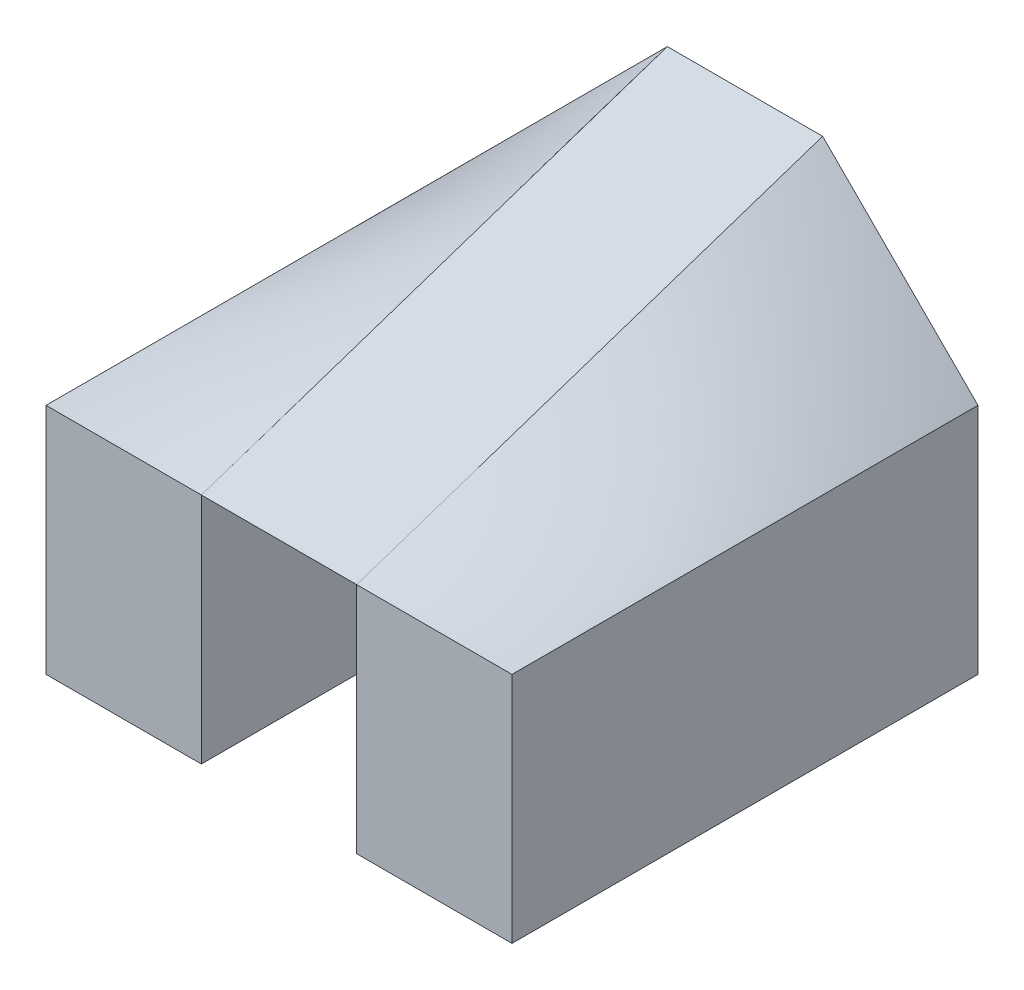
ISO-10303-21;
HEADER;
FILE_DESCRIPTION(('STEP AP214'),'2;1');
FILE_NAME('part.step','',(''),(''),'','','');
FILE_SCHEMA(('AUTOMOTIVE_DESIGN { 1 0 10303 214 1 1 1 1 }'));
ENDSEC;
DATA;
#1=APPLICATION_CONTEXT('core data for automotive mechanical design processes');
#2=APPLICATION_PROTOCOL_DEFINITION('international standard','automotive_design',2000,#1);
#3=PRODUCT_CONTEXT('',#1,'mechanical');
#4=PRODUCT('Part','Part','',(#3));
#5=PRODUCT_RELATED_PRODUCT_CATEGORY('part','',(#4));
#6=PRODUCT_DEFINITION_FORMATION('','',#4);
#7=PRODUCT_DEFINITION_CONTEXT('part definition',#1,'design');
#8=PRODUCT_DEFINITION('design','',#6,#7);
#9=PRODUCT_DEFINITION_SHAPE('','',#8);
#10=(LENGTH_UNIT() NAMED_UNIT(*) SI_UNIT(.MILLI.,.METRE.));
#11=(NAMED_UNIT(*) PLANE_ANGLE_UNIT() SI_UNIT($,.RADIAN.));
#12=(NAMED_UNIT(*) SI_UNIT($,.STERADIAN.) SOLID_ANGLE_UNIT());
#13=UNCERTAINTY_MEASURE_WITH_UNIT(LENGTH_MEASURE(1.E-05),#10,'distance_accuracy_value','');
#14=(GEOMETRIC_REPRESENTATION_CONTEXT(3) GLOBAL_UNCERTAINTY_ASSIGNED_CONTEXT((#13)) GLOBAL_UNIT_ASSIGNED_CONTEXT((#10,
#11,#12)) REPRESENTATION_CONTEXT('',''));
#15=CARTESIAN_POINT('',(0.,0.,0.));
#16=DIRECTION('',(0.,0.,1.));
#17=DIRECTION('',(1.,0.,0.));
#18=AXIS2_PLACEMENT_3D('',#15,#16,#17);
#19=CARTESIAN_POINT('',(-3.,5.,3.));
#20=DIRECTION('',(0.,0.,-1.));
#21=DIRECTION('',(-1.,0.,0.));
#22=AXIS2_PLACEMENT_3D('',#19,#20,#21);
#23=PLANE('',#22);
#24=DIRECTION('',(0.,-1.,0.));
#25=VECTOR('',#24,1.);
#26=CARTESIAN_POINT('',(-1.,0.,3.));
#27=LINE('',#26,#25);
#28=CARTESIAN_POINT('',(-1.0000279501249,3.00060685749691,3.00000931670194));
#29=VERTEX_POINT('',#28);
#30=CARTESIAN_POINT('',(-1.,0.,3.));
#31=VERTEX_POINT('',#30);
#32=EDGE_CURVE('E283',#29,#31,#27,.T.);
#33=ORIENTED_EDGE('',*,*,#32,.F.);
#34=CARTESIAN_POINT('',(-2.99959848829282,2.99919697658563,2.99986616276427));
#35=CARTESIAN_POINT('',(-2.91647727481364,2.99979623435169,2.99996603905861));
#36=CARTESIAN_POINT('',(-2.83335501740166,3.00020355740001,3.00003392623333));
#37=CARTESIAN_POINT('',(-2.66696415510001,3.00072593941439,3.0001209899024));
#38=CARTESIAN_POINT('',(-2.58369554846091,3.00084048608403,3.00014008101401));
#39=CARTESIAN_POINT('',(-2.41705834700196,3.00086747866127,3.00014457977688));
#40=CARTESIAN_POINT('',(-2.33368975229141,3.00077968150188,3.00012994691698));
#41=CARTESIAN_POINT('',(-2.16690313525018,3.00050526432254,3.00008421072042));
#42=CARTESIAN_POINT('',(-2.08348511303799,3.0003185855076,3.0000530975846));
#43=CARTESIAN_POINT('',(-1.91665073254185,2.9999497594847,2.99999162658078));
#44=CARTESIAN_POINT('',(-1.83323437425811,2.99976761218586,2.99996126869764));
#45=CARTESIAN_POINT('',(-1.66645095476638,2.99950413098206,2.99991735516368));
#46=CARTESIAN_POINT('',(-1.58308389367629,2.99942273732277,2.9999037895538));
#47=CARTESIAN_POINT('',(-1.41643937923708,2.99944448661917,2.99990741443653));
#48=CARTESIAN_POINT('',(-1.33316192593796,2.99954743121545,2.99992457186924));
#49=CARTESIAN_POINT('',(-1.16672592382412,2.99999150327888,2.99999858387982));
#50=CARTESIAN_POINT('',(-1.08356737404379,3.00033229240378,3.0000553820673));
#51=CARTESIAN_POINT('',(-1.00040952562356,3.00081905012939,3.0001365083549));
#52=B_SPLINE_CURVE_WITH_KNOTS('',3,(#34,#35,#36,#37,#38,#39,#40,#41,#42,#43,#44,#45,#46,#47,#48,
#49,#50,#51),.UNSPECIFIED.,.F.,.F.,(4,2,2,2,2,2,2,2,4),(0.,0.249369539063633,0.499175124002452,
0.749280946073541,0.999535648191619,1.24978532717036,1.49988651845285,1.749718747041,
1.99919630290931),.UNSPECIFIED.);
#53=CARTESIAN_POINT('',(-3.,2.99959683599818,3.));
#54=VERTEX_POINT('',#53);
#55=EDGE_CURVE('E77',#54,#29,#52,.T.);
#56=ORIENTED_EDGE('',*,*,#55,.F.);
#57=DIRECTION('',(0.,-1.,0.));
#58=VECTOR('',#57,1.);
#59=CARTESIAN_POINT('',(-3.,5.,3.));
#60=LINE('',#59,#58);
#61=CARTESIAN_POINT('',(-3.,0.,3.));
#62=VERTEX_POINT('',#61);
#63=EDGE_CURVE('E114',#54,#62,#60,.T.);
#64=ORIENTED_EDGE('',*,*,#63,.T.);
#65=DIRECTION('',(1.,0.,0.));
#66=VECTOR('',#65,1.);
#67=CARTESIAN_POINT('',(-3.,0.,3.));
#68=LINE('',#67,#66);
#69=EDGE_CURVE('E128',#62,#31,#68,.T.);
#70=ORIENTED_EDGE('',*,*,#69,.T.);
#71=EDGE_LOOP('',(#33,#56,#64,#70));
#72=FACE_BOUND('',#71,.T.);
#73=ADVANCED_FACE('F33',(#72),#23,.F.);
#74=CARTESIAN_POINT('',(0.,0.,0.));
#75=DIRECTION('',(0.,-1.,0.));
#76=DIRECTION('',(0.,0.,-1.));
#77=AXIS2_PLACEMENT_3D('',#74,#75,#76);
#78=PLANE('',#77);
#79=DIRECTION('',(-1.,0.,0.));
#80=VECTOR('',#79,1.);
#81=CARTESIAN_POINT('',(-3.,0.,-3.));
#82=LINE('',#81,#80);
#83=CARTESIAN_POINT('',(-1.,0.,-3.));
#84=VERTEX_POINT('',#83);
#85=CARTESIAN_POINT('',(-3.,0.,-3.));
#86=VERTEX_POINT('',#85);
#87=EDGE_CURVE('E117',#84,#86,#82,.T.);
#88=ORIENTED_EDGE('',*,*,#87,.F.);
#89=DIRECTION('',(0.,0.,-1.));
#90=VECTOR('',#89,1.);
#91=CARTESIAN_POINT('',(-1.,0.,0.));
#92=LINE('',#91,#90);
#93=EDGE_CURVE('E275',#31,#84,#92,.T.);
#94=ORIENTED_EDGE('',*,*,#93,.F.);
#95=ORIENTED_EDGE('',*,*,#69,.F.);
#96=DIRECTION('',(0.,0.,1.));
#97=VECTOR('',#96,1.);
#98=CARTESIAN_POINT('',(-3.,0.,3.));
#99=LINE('',#98,#97);
#100=EDGE_CURVE('E107',#86,#62,#99,.T.);
#101=ORIENTED_EDGE('',*,*,#100,.F.);
#102=EDGE_LOOP('',(#88,#94,#95,#101));
#103=FACE_BOUND('',#102,.T.);
#104=ADVANCED_FACE('F126',(#103),#78,.T.);
#105=DIRECTION('',(0.,-1.,0.));
#106=VECTOR('',#105,1.);
#107=CARTESIAN_POINT('',(3.,5.,3.));
#108=LINE('',#107,#106);
#109=CARTESIAN_POINT('',(3.,2.99959683599818,3.));
#110=VERTEX_POINT('',#109);
#111=CARTESIAN_POINT('',(3.,0.,3.));
#112=VERTEX_POINT('',#111);
#113=EDGE_CURVE('E63',#110,#112,#108,.T.);
#114=ORIENTED_EDGE('',*,*,#113,.F.);
#115=CARTESIAN_POINT('',(1.00040952562356,3.00081905012939,3.0001365083549));
#116=CARTESIAN_POINT('',(1.08356737404379,3.00033229240378,3.0000553820673));
#117=CARTESIAN_POINT('',(1.16672592382412,2.99999150327888,2.99999858387981));
#118=CARTESIAN_POINT('',(1.33316192593796,2.99954743121545,2.99992457186924));
#119=CARTESIAN_POINT('',(1.41643937923708,2.99944448661917,2.99990741443653));
#120=CARTESIAN_POINT('',(1.58308389367629,2.99942273732277,2.9999037895538));
#121=CARTESIAN_POINT('',(1.66645095476638,2.99950413098206,2.99991735516368));
#122=CARTESIAN_POINT('',(1.83323437425811,2.99976761218586,2.99996126869764));
#123=CARTESIAN_POINT('',(1.91665073254185,2.9999497594847,2.99999162658078));
#124=CARTESIAN_POINT('',(2.08348511303799,3.0003185855076,3.0000530975846));
#125=CARTESIAN_POINT('',(2.16690313525018,3.00050526432254,3.00008421072042));
#126=CARTESIAN_POINT('',(2.33368975229141,3.00077968150188,3.00012994691698));
#127=CARTESIAN_POINT('',(2.41705834700195,3.00086747866127,3.00014457977688));
#128=CARTESIAN_POINT('',(2.58369554846091,3.00084048608404,3.00014008101401));
#129=CARTESIAN_POINT('',(2.6669641551,3.00072593941439,3.0001209899024));
#130=CARTESIAN_POINT('',(2.83335501740166,3.00020355740001,3.00003392623333));
#131=CARTESIAN_POINT('',(2.91647727481364,2.99979623435169,2.99996603905861));
#132=CARTESIAN_POINT('',(2.99959848829282,2.99919697658563,2.99986616276427));
#133=B_SPLINE_CURVE_WITH_KNOTS('',3,(#115,#116,#117,#118,#119,#120,#121,#122,#123,#124,#125,
#126,#127,#128,#129,#130,#131,#132),.UNSPECIFIED.,.F.,.F.,(4,2,2,2,2,2,2,2,4),(0.,
0.249477555868311,0.499309784456458,0.749410975738948,0.999660654717689,1.24991535683577,
1.50002117890685,1.74982676384567,1.99919630290931),.UNSPECIFIED.);
#134=CARTESIAN_POINT('',(1.0001127605496,3.00061488382368,3.00003758682422));
#135=VERTEX_POINT('',#134);
#136=EDGE_CURVE('E163',#110,#135,#133,.F.);
#137=ORIENTED_EDGE('',*,*,#136,.T.);
#138=DIRECTION('',(0.,-1.,0.));
#139=VECTOR('',#138,1.);
#140=CARTESIAN_POINT('',(1.,0.,3.));
#141=LINE('',#140,#139);
#142=CARTESIAN_POINT('',(1.,0.,3.));
#143=VERTEX_POINT('',#142);
#144=EDGE_CURVE('E280',#135,#143,#141,.T.);
#145=ORIENTED_EDGE('',*,*,#144,.T.);
#146=EDGE_CURVE('E129',#143,#112,#68,.T.);
#147=ORIENTED_EDGE('',*,*,#146,.T.);
#148=EDGE_LOOP('',(#114,#137,#145,#147));
#149=FACE_BOUND('',#148,.T.);
#150=ADVANCED_FACE('F170',(#149),#23,.F.);
#151=CARTESIAN_POINT('',(3.,5.,3.));
#152=DIRECTION('',(-1.,0.,0.));
#153=DIRECTION('',(0.,0.,1.));
#154=AXIS2_PLACEMENT_3D('',#151,#152,#153);
#155=PLANE('',#154);
#156=DIRECTION('',(0.,-1.,0.));
#157=VECTOR('',#156,1.);
#158=CARTESIAN_POINT('',(3.,5.,-3.));
#159=LINE('',#158,#157);
#160=CARTESIAN_POINT('',(3.,3.00012492231327,-3.));
#161=VERTEX_POINT('',#160);
#162=CARTESIAN_POINT('',(3.,0.,-3.));
#163=VERTEX_POINT('',#162);
#164=EDGE_CURVE('E11',#161,#163,#159,.T.);
#165=ORIENTED_EDGE('',*,*,#164,.F.);
#166=CARTESIAN_POINT('',(2.99959848829282,2.99919697658563,2.99986616276427));
#167=CARTESIAN_POINT('',(2.99997593175919,2.99995186351839,2.74992936397604));
#168=CARTESIAN_POINT('',(3.00012683985326,3.00025367970652,2.49999214707375));
#169=CARTESIAN_POINT('',(3.0002017292695,3.000403458539,2.00004205960252));
#170=CARTESIAN_POINT('',(3.00012564219906,3.00025128439812,1.7500291889308));
#171=CARTESIAN_POINT('',(2.99997272777285,2.9999454555457,1.2499950386083));
#172=CARTESIAN_POINT('',(2.99989590039181,2.99979180078362,0.99997375896282));
#173=CARTESIAN_POINT('',(2.99981862202035,2.9996372440407,0.499951634790032));
#174=CARTESIAN_POINT('',(2.99981816475162,2.99963632950325,0.249950790272502));
#175=CARTESIAN_POINT('',(2.99988173538349,2.99976347076698,-0.250032437675042));
#176=CARTESIAN_POINT('',(2.99994575854183,2.99989151708366,-0.500014821110642));
#177=CARTESIAN_POINT('',(3.00007096029036,3.00014192058073,-0.999981075193913));
#178=CARTESIAN_POINT('',(3.00013213886384,3.00026427772768,-1.24996494584169));
#179=CARTESIAN_POINT('',(3.00017487236594,3.00034974473187,-1.7499510908798));
#180=CARTESIAN_POINT('',(3.00015642144206,3.00031284288412,-1.99995336527238));
#181=CARTESIAN_POINT('',(3.00010974711902,3.00021949423804,-2.49996117144019));
#182=CARTESIAN_POINT('',(3.00008152359244,3.00016304718488,-2.74996670321539));
#183=CARTESIAN_POINT('',(3.00008334759396,3.00016669518791,-2.99997221746868));
#184=B_SPLINE_CURVE_WITH_KNOTS('',3,(#166,#167,#168,#169,#170,#171,#172,#173,#174,#175,#176,
#177,#178,#179,#180,#181,#182,#183),.UNSPECIFIED.,.F.,.F.,(4,2,2,2,2,2,2,2,4),(0.,
0.749812470455122,1.4998508788157,2.24991497715056,2.99991741345574,3.74986469444001,
4.49981638280283,5.2498231909918,5.9998397781837),.UNSPECIFIED.);
#185=EDGE_CURVE('E148',#161,#110,#184,.F.);
#186=ORIENTED_EDGE('',*,*,#185,.T.);
#187=ORIENTED_EDGE('',*,*,#113,.T.);
#188=DIRECTION('',(0.,0.,-1.));
#189=VECTOR('',#188,1.);
#190=CARTESIAN_POINT('',(3.,0.,3.));
#191=LINE('',#190,#189);
#192=EDGE_CURVE('E124',#112,#163,#191,.T.);
#193=ORIENTED_EDGE('',*,*,#192,.T.);
#194=EDGE_LOOP('',(#165,#186,#187,#193));
#195=FACE_BOUND('',#194,.T.);
#196=ADVANCED_FACE('F35',(#195),#155,.F.);
#197=CARTESIAN_POINT('',(-3.,5.,-3.));
#198=DIRECTION('',(0.,0.,1.));
#199=DIRECTION('',(1.,0.,0.));
#200=AXIS2_PLACEMENT_3D('',#197,#198,#199);
#201=PLANE('',#200);
#202=DIRECTION('',(1.,0.,0.));
#203=VECTOR('',#202,1.);
#204=CARTESIAN_POINT('',(-1.,5.,-3.));
#205=LINE('',#204,#203);
#206=CARTESIAN_POINT('',(-1.0000651634137,5.,-3.));
#207=VERTEX_POINT('',#206);
#208=CARTESIAN_POINT('',(1.,5.,-2.9998043483756));
#209=VERTEX_POINT('',#208);
#210=EDGE_CURVE('E264',#207,#209,#205,.T.);
#211=ORIENTED_EDGE('',*,*,#210,.T.);
#212=CARTESIAN_POINT('',(3.00008334759396,3.00016669518791,-2.99997221746868));
#213=CARTESIAN_POINT('',(2.91666842650898,3.08337444959412,-2.99999523598855));
#214=CARTESIAN_POINT('',(2.83329704611942,3.16662580070212,-3.00000857257539));
#215=CARTESIAN_POINT('',(2.66658875639256,3.33319745204313,-3.00002375461826));
#216=CARTESIAN_POINT('',(2.58325185773676,3.41651776296814,-3.00002559769946));
#217=CARTESIAN_POINT('',(2.41658796648782,3.58318107134952,-3.00002566246252));
#218=CARTESIAN_POINT('',(2.33326097514583,3.66652407005625,-3.00002388386644));
#219=CARTESIAN_POINT('',(2.16660512041995,3.83320835156353,-3.00002072533517));
#220=CARTESIAN_POINT('',(2.0832762570344,3.91654963436243,-3.00001934540035));
#221=CARTESIAN_POINT('',(1.91661272750829,4.08322252218314,-3.00001830558984));
#222=CARTESIAN_POINT('',(1.83327806154767,4.16655412738492,-3.00001864567416));
#223=CARTESIAN_POINT('',(1.66660685103842,4.33321498008502,-3.00001979654184));
#224=CARTESIAN_POINT('',(1.58327030649585,4.41654422758941,-3.00002060732386));
#225=CARTESIAN_POINT('',(1.41660498689648,4.58321876549208,-3.00001958306794));
#226=CARTESIAN_POINT('',(1.33327621243048,4.66656405648127,-3.00001774789869));
#227=CARTESIAN_POINT('',(1.16663794102537,4.83329319785179,-3.00000765123587));
#228=CARTESIAN_POINT('',(1.08332844743582,4.91667705158057,-2.99999938899818));
#229=CARTESIAN_POINT('',(1.00004193205428,5.00008386410857,-2.99998602264857));
#230=B_SPLINE_CURVE_WITH_KNOTS('',3,(#212,#213,#214,#215,#216,#217,#218,#219,#220,#221,#222,
#223,#224,#225,#226,#227,#228,#229),.UNSPECIFIED.,.F.,.F.,(4,2,2,2,2,2,2,2,4),(0.,
0.353460281812378,0.706993594560062,1.06055404020695,1.41411481182268,1.76766736318887,
2.12121889958134,2.47478798128868,2.82839800455366),.UNSPECIFIED.);
#231=EDGE_CURVE('E255',#209,#161,#230,.F.);
#232=ORIENTED_EDGE('',*,*,#231,.T.);
#233=ORIENTED_EDGE('',*,*,#164,.T.);
#234=CARTESIAN_POINT('',(1.,0.,-3.));
#235=VERTEX_POINT('',#234);
#236=EDGE_CURVE('E123',#163,#235,#82,.T.);
#237=ORIENTED_EDGE('',*,*,#236,.T.);
#238=DIRECTION('',(1.,0.,0.));
#239=VECTOR('',#238,1.);
#240=CARTESIAN_POINT('',(-1.,0.,-3.));
#241=LINE('',#240,#239);
#242=EDGE_CURVE('E90',#84,#235,#241,.T.);
#243=ORIENTED_EDGE('',*,*,#242,.F.);
#244=ORIENTED_EDGE('',*,*,#87,.T.);
#245=DIRECTION('',(0.,-1.,0.));
#246=VECTOR('',#245,1.);
#247=CARTESIAN_POINT('',(-3.,5.,-3.));
#248=LINE('',#247,#246);
#249=CARTESIAN_POINT('',(-3.,3.00012492231327,-3.));
#250=VERTEX_POINT('',#249);
#251=EDGE_CURVE('E45',#250,#86,#248,.T.);
#252=ORIENTED_EDGE('',*,*,#251,.F.);
#253=CARTESIAN_POINT('',(-1.00004193205428,5.00008386410857,-2.99998602264857));
#254=CARTESIAN_POINT('',(-1.08332844743582,4.91667705158057,-2.99999938899818));
#255=CARTESIAN_POINT('',(-1.16663794102537,4.83329319785179,-3.00000765123587));
#256=CARTESIAN_POINT('',(-1.33327621243048,4.66656405648127,-3.00001774789869));
#257=CARTESIAN_POINT('',(-1.41660498689648,4.58321876549208,-3.00001958306794));
#258=CARTESIAN_POINT('',(-1.58327030649585,4.41654422758941,-3.00002060732386));
#259=CARTESIAN_POINT('',(-1.66660685103842,4.33321498008502,-3.00001979654184));
#260=CARTESIAN_POINT('',(-1.83327806154767,4.16655412738492,-3.00001864567416));
#261=CARTESIAN_POINT('',(-1.91661272750829,4.08322252218314,-3.00001830558984));
#262=CARTESIAN_POINT('',(-2.0832762570344,3.91654963436243,-3.00001934540035));
#263=CARTESIAN_POINT('',(-2.16660512041995,3.83320835156353,-3.00002072533517));
#264=CARTESIAN_POINT('',(-2.33326097514583,3.66652407005625,-3.00002388386644));
#265=CARTESIAN_POINT('',(-2.41658796648782,3.58318107134952,-3.00002566246252));
#266=CARTESIAN_POINT('',(-2.58325185773676,3.41651776296814,-3.00002559769946));
#267=CARTESIAN_POINT('',(-2.66658875639256,3.33319745204313,-3.00002375461826));
#268=CARTESIAN_POINT('',(-2.83329704611942,3.16662580070213,-3.00000857257539));
#269=CARTESIAN_POINT('',(-2.91666842650898,3.08337444959412,-2.99999523598855));
#270=CARTESIAN_POINT('',(-3.00008334759396,3.00016669518791,-2.99997221746868));
#271=B_SPLINE_CURVE_WITH_KNOTS('',3,(#253,#254,#255,#256,#257,#258,#259,#260,#261,#262,#263,
#264,#265,#266,#267,#268,#269,#270),.UNSPECIFIED.,.F.,.F.,(4,2,2,2,2,2,2,2,4),(0.,
0.353610023264976,0.707179104972321,1.06073064136479,1.41428319273098,1.76784396434671,
2.1214044099936,2.47493772274128,2.82839800455366),.UNSPECIFIED.);
#272=EDGE_CURVE('E336',#207,#250,#271,.T.);
#273=ORIENTED_EDGE('',*,*,#272,.F.);
#274=EDGE_LOOP('',(#211,#232,#233,#237,#243,#244,#252,#273));
#275=FACE_BOUND('',#274,.T.);
#276=ADVANCED_FACE('F119',(#275),#201,.F.);
#277=CARTESIAN_POINT('',(-3.,5.,3.));
#278=DIRECTION('',(1.,0.,0.));
#279=DIRECTION('',(0.,0.,-1.));
#280=AXIS2_PLACEMENT_3D('',#277,#278,#279);
#281=PLANE('',#280);
#282=ORIENTED_EDGE('',*,*,#63,.F.);
#283=CARTESIAN_POINT('',(-3.00008334759396,3.00016669518791,-2.99997221746868));
#284=CARTESIAN_POINT('',(-3.00008152359244,3.00016304718488,-2.74996670321539));
#285=CARTESIAN_POINT('',(-3.00010974711902,3.00021949423804,-2.49996117144019));
#286=CARTESIAN_POINT('',(-3.00015642144206,3.00031284288412,-1.99995336527238));
#287=CARTESIAN_POINT('',(-3.00017487236594,3.00034974473187,-1.7499510908798));
#288=CARTESIAN_POINT('',(-3.00013213886384,3.00026427772768,-1.24996494584169));
#289=CARTESIAN_POINT('',(-3.00007096029036,3.00014192058073,-0.999981075193913));
#290=CARTESIAN_POINT('',(-2.99994575854183,2.99989151708366,-0.500014821110642));
#291=CARTESIAN_POINT('',(-2.99988173538349,2.99976347076698,-0.250032437675042));
#292=CARTESIAN_POINT('',(-2.99981816475163,2.99963632950325,0.249950790272502));
#293=CARTESIAN_POINT('',(-2.99981862202035,2.9996372440407,0.499951634790032));
#294=CARTESIAN_POINT('',(-2.99989590039181,2.99979180078362,0.99997375896282));
#295=CARTESIAN_POINT('',(-2.99997272777285,2.9999454555457,1.2499950386083));
#296=CARTESIAN_POINT('',(-3.00012564219906,3.00025128439812,1.7500291889308));
#297=CARTESIAN_POINT('',(-3.0002017292695,3.000403458539,2.00004205960252));
#298=CARTESIAN_POINT('',(-3.00012683985326,3.00025367970652,2.49999214707375));
#299=CARTESIAN_POINT('',(-2.99997593175919,2.99995186351839,2.74992936397604));
#300=CARTESIAN_POINT('',(-2.99959848829282,2.99919697658563,2.99986616276427));
#301=B_SPLINE_CURVE_WITH_KNOTS('',3,(#283,#284,#285,#286,#287,#288,#289,#290,#291,#292,#293,
#294,#295,#296,#297,#298,#299,#300),.UNSPECIFIED.,.F.,.F.,(4,2,2,2,2,2,2,2,4),(0.,
0.750016587191901,1.50002339538087,2.24997508374369,2.99992236472796,3.74992480103314,
4.49998889936801,5.25002730772858,5.9998397781837),.UNSPECIFIED.);
#302=EDGE_CURVE('E110',#250,#54,#301,.T.);
#303=ORIENTED_EDGE('',*,*,#302,.F.);
#304=ORIENTED_EDGE('',*,*,#251,.T.);
#305=ORIENTED_EDGE('',*,*,#100,.T.);
#306=EDGE_LOOP('',(#282,#303,#304,#305));
#307=FACE_BOUND('',#306,.T.);
#308=ADVANCED_FACE('F105',(#307),#281,.F.);
#309=DIRECTION('',(0.,0.,-1.));
#310=VECTOR('',#309,1.);
#311=CARTESIAN_POINT('',(1.,0.,0.));
#312=LINE('',#311,#310);
#313=EDGE_CURVE('E276',#143,#235,#312,.T.);
#314=ORIENTED_EDGE('',*,*,#313,.T.);
#315=ORIENTED_EDGE('',*,*,#236,.F.);
#316=ORIENTED_EDGE('',*,*,#192,.F.);
#317=ORIENTED_EDGE('',*,*,#146,.F.);
#318=EDGE_LOOP('',(#314,#315,#316,#317));
#319=FACE_BOUND('',#318,.T.);
#320=ADVANCED_FACE('F180',(#319),#78,.T.);
#321=CARTESIAN_POINT('',(-1.,3.6,1.2));
#322=DIRECTION('',(0.,0.948683298050514,0.316227766016838));
#323=DIRECTION('',(0.,-0.316227766016838,0.948683298050514));
#324=AXIS2_PLACEMENT_3D('',#321,#322,#323);
#325=PLANE('',#324);
#326=CARTESIAN_POINT('',(1.00000000000074,3.52322347464704,1.43032957606359));
#327=CARTESIAN_POINT('',(0.999984028336113,3.50613434110382,1.48149582281727));
#328=CARTESIAN_POINT('',(0.999967760795479,3.48904464550614,1.53266188185296));
#329=CARTESIAN_POINT('',(0.999936100370009,3.45486700362154,1.63499429147876));
#330=CARTESIAN_POINT('',(0.999920707480669,3.43777905732607,1.68616064206602));
#331=CARTESIAN_POINT('',(0.999892262771388,3.40360785227671,1.78849410738866));
#332=CARTESIAN_POINT('',(0.999879210918441,3.38652459346012,1.8396612221031));
#333=CARTESIAN_POINT('',(0.999857241299585,3.35236634802045,1.94199681750268));
#334=CARTESIAN_POINT('',(0.999848323432179,3.33529136120457,1.99316529812344));
#335=CARTESIAN_POINT('',(0.999836662219659,3.3011537411323,2.09550430399427));
#336=CARTESIAN_POINT('',(0.999833918648988,3.28409110744741,2.14667482910136));
#337=CARTESIAN_POINT('',(0.999836930396672,3.24998284184888,2.24901870029895));
#338=CARTESIAN_POINT('',(0.999842685289695,3.2329372091271,2.30019204612011));
#339=CARTESIAN_POINT('',(0.999865275411283,3.19886810969111,2.40254241519814));
#340=CARTESIAN_POINT('',(0.999882109918637,3.18184464160639,2.45371943799888));
#341=CARTESIAN_POINT('',(0.999929802361992,3.14782575216883,2.55607815845278));
#342=CARTESIAN_POINT('',(0.999960659153186,3.13083032864005,2.60725985538336));
#343=CARTESIAN_POINT('',(0.999999999999996,3.11385103323988,2.65844690028033));
#344=B_SPLINE_CURVE_WITH_KNOTS('',3,(#326,#327,#328,#329,#330,#331,#332,#333,#334,#335,#336,
#337,#338,#339,#340,#341,#342,#343),.UNSPECIFIED.,.F.,.F.,(4,2,2,2,2,2,2,2,4),(0.,
0.161833902440231,0.323666971318129,0.485497758323447,0.647324571914133,0.809145473603988,
0.970958276731668,1.13276054795467,1.29454961171518),.UNSPECIFIED.);
#345=CARTESIAN_POINT('',(1.,3.11385103323842,2.65844690028473));
#346=VERTEX_POINT('',#345);
#347=CARTESIAN_POINT('',(1.00000000000037,3.52322347464633,1.43032957606335));
#348=VERTEX_POINT('',#347);
#349=EDGE_CURVE('E53',#346,#348,#344,.F.);
#350=ORIENTED_EDGE('',*,*,#349,.T.);
#351=CARTESIAN_POINT('',(1.,4.18567767252243,-0.55703301756729));
#352=CARTESIAN_POINT('',(1.00002296434565,4.15812126426369,-0.474218351935302));
#353=CARTESIAN_POINT('',(1.00004556878963,4.1305641718863,-0.391403913324579));
#354=CARTESIAN_POINT('',(1.00008747068365,4.07544337313816,-0.225776138418027));
#355=CARTESIAN_POINT('',(1.0001067680942,4.04787966669237,-0.142962802147159));
#356=CARTESIAN_POINT('',(1.00013946840025,3.99274047615042,0.022661871416964));
#357=CARTESIAN_POINT('',(1.00015287117267,3.9651649918204,0.105473208632391));
#358=CARTESIAN_POINT('',(1.0001718884864,3.90999845971644,0.271093247931233));
#359=CARTESIAN_POINT('',(1.00017750281201,3.88240741153263,0.353901949878156));
#360=CARTESIAN_POINT('',(1.00017983910473,3.82720754810601,0.519516336678598));
#361=CARTESIAN_POINT('',(1.00017656079112,3.7995987323298,0.602322021354344));
#362=CARTESIAN_POINT('',(1.00016107159454,3.74436325402578,0.76793035802144));
#363=CARTESIAN_POINT('',(1.00014886042806,3.71673659095931,0.850733009833103));
#364=CARTESIAN_POINT('',(1.00011656715889,3.66146755296709,1.01633559977171));
#365=CARTESIAN_POINT('',(1.00009648483965,3.63382517762995,1.09913553776129));
#366=CARTESIAN_POINT('',(1.00005129739117,3.57853038132905,1.26473373949027));
#367=CARTESIAN_POINT('',(1.00002619217017,3.55087796019098,1.34753200317145));
#368=CARTESIAN_POINT('',(1.00000000000074,3.52322347464704,1.43032957606359));
#369=B_SPLINE_CURVE_WITH_KNOTS('',3,(#351,#352,#353,#354,#355,#356,#357,#358,#359,#360,#361,
#362,#363,#364,#365,#366,#367,#368),.UNSPECIFIED.,.F.,.F.,(4,2,2,2,2,2,2,2,4),(0.,
0.261837020847786,0.523677167348795,0.785522780337954,1.04737564498826,1.30923677607712,
1.57110621895133,1.83298286727951,2.0948642998587),.UNSPECIFIED.);
#370=CARTESIAN_POINT('',(1.,4.18567767252243,-0.55703301756729));
#371=VERTEX_POINT('',#370);
#372=EDGE_CURVE('E246',#371,#348,#369,.T.);
#373=ORIENTED_EDGE('',*,*,#372,.F.);
#374=CARTESIAN_POINT('',(0.999999999999999,4.91291069102708,-2.73873207308124));
#375=CARTESIAN_POINT('',(0.999978540439921,4.88256620840119,-2.64783453575074));
#376=CARTESIAN_POINT('',(0.999954062821278,4.8522159925181,-2.55693891301955));
#377=CARTESIAN_POINT('',(0.999905954757653,4.79151725509804,-2.37514738516233));
#378=CARTESIAN_POINT('',(0.999882324310294,4.76116873355656,-2.2842514800378));
#379=CARTESIAN_POINT('',(0.999842794143266,4.70048708279714,-2.10245688548408));
#380=CARTESIAN_POINT('',(0.999826894243325,4.67015395323677,-2.01155819616924));
#381=CARTESIAN_POINT('',(0.999805593513351,4.6095086550664,-1.8297572062813));
#382=CARTESIAN_POINT('',(0.999800192331789,4.57919648578856,-1.73885490593102));
#383=CARTESIAN_POINT('',(0.999800439202655,4.5185942127107,-1.55704652318194));
#384=CARTESIAN_POINT('',(0.999806086864241,4.48830410816807,-1.46614044103067));
#385=CARTESIAN_POINT('',(0.999827001848248,4.42774311687906,-1.28432500559825));
#386=CARTESIAN_POINT('',(0.999842268872663,4.39747222956641,-1.19341565250567));
#387=CARTESIAN_POINT('',(0.999879691566275,4.3369442172336,-1.01159460511438));
#388=CARTESIAN_POINT('',(0.999901847082781,4.30668709192328,-0.920682910912217));
#389=CARTESIAN_POINT('',(0.999949401870834,4.24617932881121,-0.738858441251688));
#390=CARTESIAN_POINT('',(0.999974801107785,4.21592869094372,-0.647945665815191));
#391=CARTESIAN_POINT('',(1.,4.18567767252243,-0.55703301756729));
#392=B_SPLINE_CURVE_WITH_KNOTS('',3,(#374,#375,#376,#377,#378,#379,#380,#381,#382,#383,#384,
#385,#386,#387,#388,#389,#390,#391),.UNSPECIFIED.,.F.,.F.,(4,2,2,2,2,2,2,2,4),(0.,
0.287486266888819,0.574971727045342,0.862450482943212,1.14991961302761,1.43737857436149,
1.72482863072379,2.01227231588533,2.29971293555773),.UNSPECIFIED.);
#393=CARTESIAN_POINT('',(0.999999999999999,4.91291069102708,-2.73873207308124));
#394=VERTEX_POINT('',#393);
#395=EDGE_CURVE('E250',#394,#371,#392,.T.);
#396=ORIENTED_EDGE('',*,*,#395,.F.);
#397=CARTESIAN_POINT('',(1.00004193205429,5.00008386410857,-2.99998602264857));
#398=CARTESIAN_POINT('',(1.0000411867277,4.99645363667057,-2.98910006073628));
#399=CARTESIAN_POINT('',(1.00004028129216,4.99282310504326,-2.97821420027945));
#400=CARTESIAN_POINT('',(1.00003817732316,4.98556145559259,-2.95644257706441));
#401=CARTESIAN_POINT('',(1.00003697878734,4.98193033776473,-2.9455568143077));
#402=CARTESIAN_POINT('',(1.00003431574095,4.97466757013834,-2.92378537738901));
#403=CARTESIAN_POINT('',(1.00003285122843,4.97103592033611,-2.91289970322827));
#404=CARTESIAN_POINT('',(1.0000296820587,4.96377214042711,-2.89112843490959));
#405=CARTESIAN_POINT('',(1.00002797739989,4.96014001031732,-2.88024284075267));
#406=CARTESIAN_POINT('',(1.00002435284929,4.95287531961499,-2.85847172413284));
#407=CARTESIAN_POINT('',(1.00002243295621,4.94924275902002,-2.84758620167073));
#408=CARTESIAN_POINT('',(1.00001840183093,4.94197725513711,-2.8258152204821));
#409=CARTESIAN_POINT('',(1.00001629059772,4.93834431184724,-2.81492976175621));
#410=CARTESIAN_POINT('',(1.00001189979521,4.9310780885756,-2.79315890035716));
#411=CARTESIAN_POINT('',(1.00000962022513,4.92744480859233,-2.7822734976845));
#412=CARTESIAN_POINT('',(1.00000491455587,4.92017795556752,-2.76050274118204));
#413=CARTESIAN_POINT('',(1.00000248845609,4.91654438252485,-2.74961738735262));
#414=CARTESIAN_POINT('',(0.999999999999999,4.91291069102708,-2.73873207308124));
#415=B_SPLINE_CURVE_WITH_KNOTS('',3,(#397,#398,#399,#400,#401,#402,#403,#404,#405,#406,#407,
#408,#409,#410,#411,#412,#413,#414),.UNSPECIFIED.,.F.,.F.,(4,2,2,2,2,2,2,2,4),(0.,
0.034425927239405,0.0688521329402428,0.103278591636193,0.137705278797789,0.17213217081988,
0.206559245008762,0.240986479569114,0.27541385359063),.UNSPECIFIED.);
#416=EDGE_CURVE('E274',#209,#394,#415,.T.);
#417=ORIENTED_EDGE('',*,*,#416,.F.);
#418=ORIENTED_EDGE('',*,*,#210,.F.);
#419=CARTESIAN_POINT('',(-0.999999999999997,3.11385103323952,2.65844690028144));
#420=CARTESIAN_POINT('',(-0.999840375102179,3.19213250673844,2.4225915220985));
#421=CARTESIAN_POINT('',(-0.999819688371416,3.27067794910292,2.18682417904354));
#422=CARTESIAN_POINT('',(-0.999892933509361,3.42799807151166,1.71532769769098));
#423=CARTESIAN_POINT('',(-0.999986882106766,3.50677278333943,1.47959856999123));
#424=CARTESIAN_POINT('',(-1.00012608910877,3.66422707579123,1.00811733698182));
#425=CARTESIAN_POINT('',(-1.00017134914464,3.74290665951424,0.77236523270665));
#426=CARTESIAN_POINT('',(-1.00018451541535,3.90011220075706,0.300831995359356));
#427=CARTESIAN_POINT('',(-1.00015242820524,3.97863817073093,0.0650508664404162));
#428=CARTESIAN_POINT('',(-1.00004688689594,4.13560789449247,-0.406526733136449));
#429=CARTESIAN_POINT('',(-0.999973434690726,4.21405165187967,-0.642323202597751));
#430=CARTESIAN_POINT('',(-0.999852835763888,4.37099164432837,-1.11390697314715));
#431=CARTESIAN_POINT('',(-0.99980568987257,4.44948788096798,-1.34969427371101));
#432=CARTESIAN_POINT('',(-0.999796825986074,4.60664920119493,-1.82123437233964));
#433=CARTESIAN_POINT('',(-0.999835115093877,4.68531429827793,-2.0569871659059));
#434=CARTESIAN_POINT('',(-0.9999357892891,4.84269268438323,-2.5284847209854));
#435=CARTESIAN_POINT('',(-0.999998175117137,4.92140597481252,-2.76422948202901));
#436=CARTESIAN_POINT('',(-1.00004193205428,5.00008386410857,-2.99998602264857));
#437=B_SPLINE_CURVE_WITH_KNOTS('',3,(#419,#420,#421,#422,#423,#424,#425,#426,#427,#428,#429,
#430,#431,#432,#433,#434,#435,#436),.UNSPECIFIED.,.F.,.F.,(4,2,2,2,2,2,2,2,4),(0.,
0.745520472743453,1.49114975206516,2.23675404882486,2.98229515897055,3.72780213570698,
4.47333264148911,5.21892513223756,5.96454054070973),.UNSPECIFIED.);
#438=CARTESIAN_POINT('',(-0.999999999999998,3.11385103323952,2.65844690028144));
#439=VERTEX_POINT('',#438);
#440=EDGE_CURVE('E288',#207,#439,#437,.F.);
#441=ORIENTED_EDGE('',*,*,#440,.T.);
#442=CARTESIAN_POINT('',(-1.00040952506631,3.00081905013262,3.00013650835544));
#443=CARTESIAN_POINT('',(-1.00038551851324,3.00551492399297,2.98589684527164));
#444=CARTESIAN_POINT('',(-1.00036248865469,3.0102126560327,2.9716577933816));
#445=CARTESIAN_POINT('',(-1.00031829829006,3.019611858824,2.94318031269837));
#446=CARTESIAN_POINT('',(-1.000297137856,3.02431332971257,2.92894188395027));
#447=CARTESIAN_POINT('',(-1.00025660339241,3.03371984433184,2.90046562182309));
#448=CARTESIAN_POINT('',(-1.00023722942879,3.03842488818789,2.88622778848532));
#449=CARTESIAN_POINT('',(-1.00020018717937,3.04783838728153,2.85775269029141));
#450=CARTESIAN_POINT('',(-1.00018251895376,3.0525468426336,2.84351542547304));
#451=CARTESIAN_POINT('',(-1.00014880905965,3.06196700648024,2.81504143793707));
#452=CARTESIAN_POINT('',(-1.00013276744598,3.06667871507909,2.8008047152539));
#453=CARTESIAN_POINT('',(-1.00010223346428,3.07610523079377,2.77233178622582));
#454=CARTESIAN_POINT('',(-1.00008774114609,3.08082003800435,2.75809557991222));
#455=CARTESIAN_POINT('',(-1.00006023004845,3.09025259953673,2.72962365836334));
#456=CARTESIAN_POINT('',(-1.00004721131415,3.09497035394438,2.71538794315646));
#457=CARTESIAN_POINT('',(-1.00002257388807,3.10440866284867,2.68691697941178));
#458=CARTESIAN_POINT('',(-1.0000109552371,3.10912921742288,2.67268173089965));
#459=CARTESIAN_POINT('',(-0.999999999999997,3.11385103323952,2.65844690028144));
#460=B_SPLINE_CURVE_WITH_KNOTS('',3,(#442,#443,#444,#445,#446,#447,#448,#449,#450,#451,#452,
#453,#454,#455,#456,#457,#458,#459),.UNSPECIFIED.,.F.,.F.,(4,2,2,2,2,2,2,2,4),(0.,
0.0449819773840566,0.0899656868099747,0.134951055045609,0.17993801003736,0.224926480941537,
0.269916398153828,0.314907693336994,0.359900299446724),.UNSPECIFIED.);
#461=EDGE_CURVE('E198',#439,#29,#460,.F.);
#462=ORIENTED_EDGE('',*,*,#461,.T.);
#463=DIRECTION('',(1.,0.,0.));
#464=VECTOR('',#463,1.);
#465=CARTESIAN_POINT('',(-1.,3.,3.));
#466=LINE('',#465,#464);
#467=EDGE_CURVE('E270',#29,#135,#466,.T.);
#468=ORIENTED_EDGE('',*,*,#467,.T.);
#469=CARTESIAN_POINT('',(0.999999999999996,3.11385103323988,2.65844690028033));
#470=CARTESIAN_POINT('',(1.0000109552371,3.10912921742323,2.67268173089859));
#471=CARTESIAN_POINT('',(1.00002257388807,3.10440866284901,2.68691697941076));
#472=CARTESIAN_POINT('',(1.00004721131415,3.09497035394469,2.71538794315554));
#473=CARTESIAN_POINT('',(1.00006023004845,3.09025259953702,2.72962365836246));
#474=CARTESIAN_POINT('',(1.00008774114609,3.08082003800461,2.75809557991143));
#475=CARTESIAN_POINT('',(1.00010223346428,3.07610523079402,2.77233178622508));
#476=CARTESIAN_POINT('',(1.00013276744598,3.06667871507931,2.80080471525326));
#477=CARTESIAN_POINT('',(1.00014880905965,3.06196700648044,2.81504143793647));
#478=CARTESIAN_POINT('',(1.00018251895376,3.05254684263377,2.84351542547253));
#479=CARTESIAN_POINT('',(1.00020018717937,3.04783838728169,2.85775269029095));
#480=CARTESIAN_POINT('',(1.00023722942879,3.03842488818801,2.88622778848495));
#481=CARTESIAN_POINT('',(1.00025660339241,3.03371984433194,2.90046562182277));
#482=CARTESIAN_POINT('',(1.000297137856,3.02431332971265,2.92894188395004));
#483=CARTESIAN_POINT('',(1.00031829829006,3.01961185882406,2.94318031269818));
#484=CARTESIAN_POINT('',(1.00036248865469,3.01021265603273,2.97165779338151));
#485=CARTESIAN_POINT('',(1.00038551851324,3.00551492399298,2.98589684527159));
#486=CARTESIAN_POINT('',(1.00040952506631,3.00081905013262,3.00013650835544));
#487=B_SPLINE_CURVE_WITH_KNOTS('',3,(#469,#470,#471,#472,#473,#474,#475,#476,#477,#478,#479,
#480,#481,#482,#483,#484,#485,#486),.UNSPECIFIED.,.F.,.F.,(4,2,2,2,2,2,2,2,4),(0.,
0.0449926061098769,0.0899839012931876,0.134973818505625,0.179962289409945,0.224949244401845,
0.269934612637625,0.314918322063688,0.359900299447891),.UNSPECIFIED.);
#488=EDGE_CURVE('E254',#346,#135,#487,.T.);
#489=ORIENTED_EDGE('',*,*,#488,.F.);
#490=EDGE_LOOP('',(#350,#373,#396,#417,#418,#441,#462,#468,#489));
#491=FACE_BOUND('',#490,.T.);
#492=ADVANCED_FACE('F204',(#491),#325,.T.);
#493=CARTESIAN_POINT('',(-1.,1.2,-0.6));
#494=DIRECTION('',(0.,-0.894427190999916,0.447213595499958));
#495=DIRECTION('',(0.,-0.447213595499958,-0.894427190999916));
#496=AXIS2_PLACEMENT_3D('',#493,#494,#495);
#497=PLANE('',#496);
#498=DIRECTION('',(0.,-0.447213595499958,-0.894427190999916));
#499=VECTOR('',#498,1.);
#500=CARTESIAN_POINT('',(1.,1.2,-0.6));
#501=LINE('',#500,#499);
#502=EDGE_CURVE('E340',#135,#235,#501,.T.);
#503=ORIENTED_EDGE('',*,*,#502,.F.);
#504=ORIENTED_EDGE('',*,*,#467,.F.);
#505=DIRECTION('',(0.,-0.447213595499958,-0.894427190999916));
#506=VECTOR('',#505,1.);
#507=CARTESIAN_POINT('',(-1.,1.2,-0.6));
#508=LINE('',#507,#506);
#509=EDGE_CURVE('E279',#29,#84,#508,.T.);
#510=ORIENTED_EDGE('',*,*,#509,.T.);
#511=ORIENTED_EDGE('',*,*,#242,.T.);
#512=EDGE_LOOP('',(#503,#504,#510,#511));
#513=FACE_BOUND('',#512,.T.);
#514=ADVANCED_FACE('F213',(#513),#497,.T.);
#515=CARTESIAN_POINT('',(-1.,0.,0.));
#516=DIRECTION('',(1.,0.,0.));
#517=DIRECTION('',(0.,0.,-1.));
#518=AXIS2_PLACEMENT_3D('',#515,#516,#517);
#519=PLANE('',#518);
#520=ORIENTED_EDGE('',*,*,#509,.F.);
#521=ORIENTED_EDGE('',*,*,#32,.T.);
#522=ORIENTED_EDGE('',*,*,#93,.T.);
#523=EDGE_LOOP('',(#520,#521,#522));
#524=FACE_BOUND('',#523,.T.);
#525=ADVANCED_FACE('F312',(#524),#519,.T.);
#526=CARTESIAN_POINT('',(1.,0.,0.));
#527=DIRECTION('',(1.,0.,0.));
#528=DIRECTION('',(0.,0.,-1.));
#529=AXIS2_PLACEMENT_3D('',#526,#527,#528);
#530=PLANE('',#529);
#531=ORIENTED_EDGE('',*,*,#502,.T.);
#532=ORIENTED_EDGE('',*,*,#313,.F.);
#533=ORIENTED_EDGE('',*,*,#144,.F.);
#534=EDGE_LOOP('',(#531,#532,#533));
#535=FACE_BOUND('',#534,.T.);
#536=ADVANCED_FACE('F308',(#535),#530,.F.);
#537=CARTESIAN_POINT('',(-0.98266486983519,5.03670880355157,-3.05715000695718));
#538=CARTESIAN_POINT('',(-1.39251747465585,4.64664021158969,-3.12909242378146));
#539=CARTESIAN_POINT('',(-1.79889565668569,4.24962277404615,-3.20219298153601));
#540=CARTESIAN_POINT('',(-2.20164385734426,3.8453453737601,-3.27650353308098));
#541=CARTESIAN_POINT('',(-2.59928286905803,3.43084959558444,-3.35251714760755));
#542=CARTESIAN_POINT('',(-2.99297762742618,3.00846531071753,-3.42984551324932));
#543=CARTESIAN_POINT('',(-0.926291843361824,4.6776036490319,-1.81939980721129));
#544=CARTESIAN_POINT('',(-1.36247896289665,4.34020408649836,-1.88256405246418));
#545=CARTESIAN_POINT('',(-1.79473785626109,3.99494807162405,-1.94703770644052));
#546=CARTESIAN_POINT('',(-2.22336333441285,3.64242522632436,-2.01272249882109));
#547=CARTESIAN_POINT('',(-2.64903682525587,3.28399840640719,-2.07939128697125));
#548=CARTESIAN_POINT('',(-3.0713477886316,2.91884653155545,-2.1471809176105));
#549=CARTESIAN_POINT('',(-0.858944854543175,4.29655056982171,-0.585307594913823));
#550=CARTESIAN_POINT('',(-1.32554299354964,4.01997304623143,-0.638334833676164));
#551=CARTESIAN_POINT('',(-1.79036689555431,3.73984704863756,-0.691953484772433));
#552=CARTESIAN_POINT('',(-2.2526793066882,3.45469806930213,-0.746409299492302));
#553=CARTESIAN_POINT('',(-2.71269445344495,3.16495456121242,-0.80163086900455));
#554=CARTESIAN_POINT('',(-3.1700471928331,2.86988623838552,-0.857739907639664));
#555=CARTESIAN_POINT('',(-0.788004713573714,3.90831118630984,0.647586900000029));
#556=CARTESIAN_POINT('',(-1.28851085511455,3.69954966778832,0.605862328749153));
#557=CARTESIAN_POINT('',(-1.78767915780493,3.48811247156588,0.563691811214782));
#558=CARTESIAN_POINT('',(-2.28766304142353,3.27830643719986,0.521793153989826));
#559=CARTESIAN_POINT('',(-2.78311977974896,3.05944611224754,0.478385448333814));
#560=CARTESIAN_POINT('',(-3.27536842417175,2.83416959948992,0.433908378043587));
#561=CARTESIAN_POINT('',(-0.686520014197699,3.45898268598491,1.87029987544505));
#562=CARTESIAN_POINT('',(-1.23582618117038,3.34782121832706,1.84484197933811));
#563=CARTESIAN_POINT('',(-1.78552711919567,3.23744929277444,1.81951567358205));
#564=CARTESIAN_POINT('',(-2.33309695971305,3.122815172206,1.79347900199001));
#565=CARTESIAN_POINT('',(-2.87929596957824,3.00543939033318,1.76698538684725));
#566=CARTESIAN_POINT('',(-3.4225832420039,2.8822401335813,1.73952119255797));
#567=CARTESIAN_POINT('',(-0.565263019969753,2.97010959595609,3.08642208593941));
#568=CARTESIAN_POINT('',(-1.1721195962109,2.97404894683517,3.08014765958863));
#569=CARTESIAN_POINT('',(-1.78083808372524,2.98171212026066,3.07449387032892));
#570=CARTESIAN_POINT('',(-2.39453530209728,2.99933275540154,3.07049965802177));
#571=CARTESIAN_POINT('',(-3.00150147327406,3.0034912961519,3.06426176331621));
#572=CARTESIAN_POINT('',(-3.60281132937155,2.99633720674368,3.05613843025087));
#573=B_SPLINE_SURFACE_WITH_KNOTS('',5,5,((#537,#538,#539,#540,#541,#542),(#543,#544,#545,#546,
#547,#548),(#549,#550,#551,#552,#553,#554),(#555,#556,#557,#558,#559,#560),(#561,#562,#563,#564,
#565,#566),(#567,#568,#569,#570,#571,#572)),.UNSPECIFIED.,.F.,.F.,.F.,(6,6),(6,6),
(-3.28505756090219,3.11517867054243),(-1.31931658070655,1.39589605094578),.UNSPECIFIED.);
#574=ORIENTED_EDGE('',*,*,#55,.T.);
#575=ORIENTED_EDGE('',*,*,#461,.F.);
#576=ORIENTED_EDGE('',*,*,#440,.F.);
#577=ORIENTED_EDGE('',*,*,#272,.T.);
#578=ORIENTED_EDGE('',*,*,#302,.T.);
#579=EDGE_LOOP('',(#574,#575,#576,#577,#578));
#580=FACE_BOUND('',#579,.T.);
#581=ADVANCED_FACE('F295',(#580),#573,.F.);
#582=CARTESIAN_POINT('',(2.99297762742618,3.00846531071753,-3.42984551324932));
#583=CARTESIAN_POINT('',(2.59928286905804,3.43084959558444,-3.35251714760755));
#584=CARTESIAN_POINT('',(2.20164385734427,3.8453453737601,-3.27650353308097));
#585=CARTESIAN_POINT('',(1.79889565668568,4.24962277404615,-3.20219298153601));
#586=CARTESIAN_POINT('',(1.39251747465585,4.64664021158969,-3.12909242378146));
#587=CARTESIAN_POINT('',(0.982664869835192,5.03670880355157,-3.05715000695718));
#588=CARTESIAN_POINT('',(3.07134778863159,2.91884653155544,-2.1471809176105));
#589=CARTESIAN_POINT('',(2.64903682525586,3.28399840640719,-2.07939128697125));
#590=CARTESIAN_POINT('',(2.22336333441285,3.64242522632436,-2.01272249882109));
#591=CARTESIAN_POINT('',(1.79473785626109,3.99494807162404,-1.94703770644052));
#592=CARTESIAN_POINT('',(1.36247896289665,4.34020408649836,-1.88256405246418));
#593=CARTESIAN_POINT('',(0.926291843361817,4.6776036490319,-1.8193998072113));
#594=CARTESIAN_POINT('',(3.17004719283311,2.86988623838554,-0.857739907639664));
#595=CARTESIAN_POINT('',(2.71269445344495,3.16495456121243,-0.80163086900455));
#596=CARTESIAN_POINT('',(2.2526793066882,3.45469806930213,-0.746409299492301));
#597=CARTESIAN_POINT('',(1.79036689555432,3.73984704863757,-0.691953484772431));
#598=CARTESIAN_POINT('',(1.32554299354965,4.01997304623143,-0.63833483367616));
#599=CARTESIAN_POINT('',(0.858944854543186,4.29655056982171,-0.585307594913816));
#600=CARTESIAN_POINT('',(3.27536842417174,2.8341695994899,0.433908378043586));
#601=CARTESIAN_POINT('',(2.78311977974895,3.05944611224753,0.478385448333812));
#602=CARTESIAN_POINT('',(2.28766304142353,3.27830643719986,0.521793153989825));
#603=CARTESIAN_POINT('',(1.78767915780492,3.48811247156587,0.563691811214779));
#604=CARTESIAN_POINT('',(1.28851085511455,3.69954966778832,0.605862328749149));
#605=CARTESIAN_POINT('',(0.788004713573706,3.90831118630984,0.647586900000025));
#606=CARTESIAN_POINT('',(3.42258324200391,2.8822401335813,1.73952119255798));
#607=CARTESIAN_POINT('',(2.87929596957825,3.00543939033319,1.76698538684725));
#608=CARTESIAN_POINT('',(2.33309695971305,3.122815172206,1.79347900199001));
#609=CARTESIAN_POINT('',(1.78552711919568,3.23744929277445,1.81951567358205));
#610=CARTESIAN_POINT('',(1.23582618117038,3.34782121832706,1.84484197933811));
#611=CARTESIAN_POINT('',(0.686520014197701,3.45898268598491,1.87029987544505));
#612=CARTESIAN_POINT('',(3.60281132937155,2.99633720674367,3.05613843025087));
#613=CARTESIAN_POINT('',(3.00150147327406,3.00349129615189,3.06426176331621));
#614=CARTESIAN_POINT('',(2.39453530209728,2.99933275540154,3.07049965802177));
#615=CARTESIAN_POINT('',(1.78083808372524,2.98171212026066,3.07449387032892));
#616=CARTESIAN_POINT('',(1.1721195962109,2.97404894683517,3.08014765958863));
#617=CARTESIAN_POINT('',(0.565263019969752,2.97010959595609,3.08642208593941));
#618=B_SPLINE_SURFACE_WITH_KNOTS('',5,5,((#582,#583,#584,#585,#586,#587),(#588,#589,#590,#591,
#592,#593),(#594,#595,#596,#597,#598,#599),(#600,#601,#602,#603,#604,#605),(#606,#607,#608,#609,
#610,#611),(#612,#613,#614,#615,#616,#617)),.UNSPECIFIED.,.F.,.F.,.F.,(6,6),(6,6),
(-3.28505756090219,3.11517867054243),(-1.39589605094578,1.31931658070655),.UNSPECIFIED.);
#619=ORIENTED_EDGE('',*,*,#185,.F.);
#620=ORIENTED_EDGE('',*,*,#231,.F.);
#621=ORIENTED_EDGE('',*,*,#416,.T.);
#622=ORIENTED_EDGE('',*,*,#395,.T.);
#623=ORIENTED_EDGE('',*,*,#372,.T.);
#624=ORIENTED_EDGE('',*,*,#349,.F.);
#625=ORIENTED_EDGE('',*,*,#488,.T.);
#626=ORIENTED_EDGE('',*,*,#136,.F.);
#627=EDGE_LOOP('',(#619,#620,#621,#622,#623,#624,#625,#626));
#628=FACE_BOUND('',#627,.T.);
#629=ADVANCED_FACE('F307',(#628),#618,.F.);
#630=CLOSED_SHELL('',(#73,#104,#150,#196,#276,#308,#320,#492,#514,#525,#536,#581,#629));
#631=MANIFOLD_SOLID_BREP('B2',#630);
#632=ADVANCED_BREP_SHAPE_REPRESENTATION('',(#18,#631),#14);
#633=SHAPE_DEFINITION_REPRESENTATION(#9,#632);
ENDSEC;
END-ISO-10303-21;
